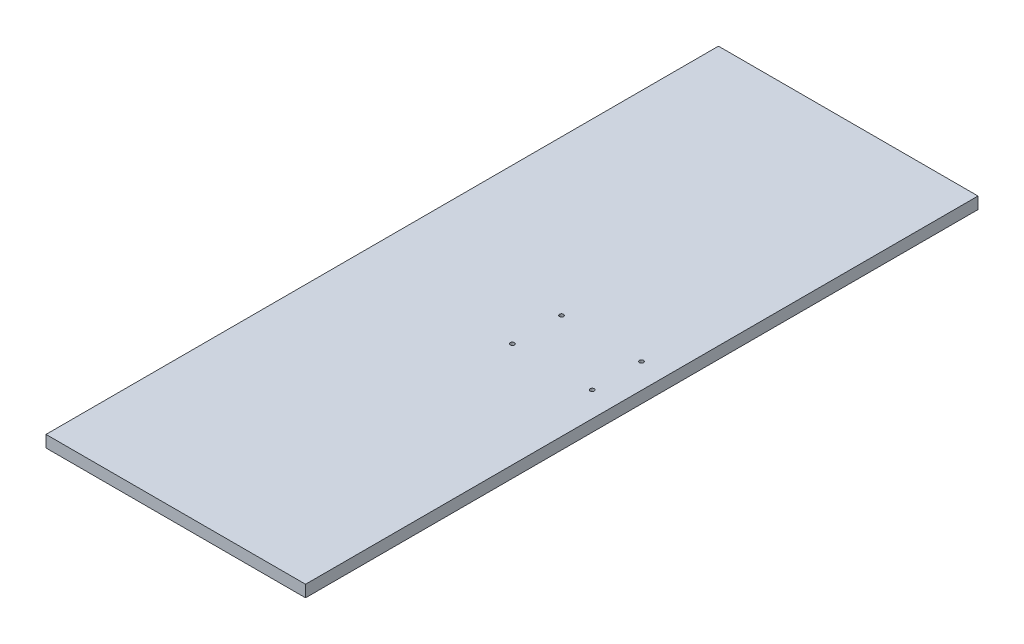
ISO-10303-21;
HEADER;
FILE_DESCRIPTION(('STEP AP214'),'2;1');
FILE_NAME('part.step','',(''),(''),'','','');
FILE_SCHEMA(('AUTOMOTIVE_DESIGN { 1 0 10303 214 1 1 1 1 }'));
ENDSEC;
DATA;
#1=APPLICATION_CONTEXT('core data for automotive mechanical design processes');
#2=APPLICATION_PROTOCOL_DEFINITION('international standard','automotive_design',2000,#1);
#3=PRODUCT_CONTEXT('',#1,'mechanical');
#4=PRODUCT('Part','Part','',(#3));
#5=PRODUCT_RELATED_PRODUCT_CATEGORY('part','',(#4));
#6=PRODUCT_DEFINITION_FORMATION('','',#4);
#7=PRODUCT_DEFINITION_CONTEXT('part definition',#1,'design');
#8=PRODUCT_DEFINITION('design','',#6,#7);
#9=PRODUCT_DEFINITION_SHAPE('','',#8);
#10=(LENGTH_UNIT() NAMED_UNIT(*) SI_UNIT(.MILLI.,.METRE.));
#11=(NAMED_UNIT(*) PLANE_ANGLE_UNIT() SI_UNIT($,.RADIAN.));
#12=(NAMED_UNIT(*) SI_UNIT($,.STERADIAN.) SOLID_ANGLE_UNIT());
#13=UNCERTAINTY_MEASURE_WITH_UNIT(LENGTH_MEASURE(1.E-05),#10,'distance_accuracy_value','');
#14=(GEOMETRIC_REPRESENTATION_CONTEXT(3) GLOBAL_UNCERTAINTY_ASSIGNED_CONTEXT((#13)) GLOBAL_UNIT_ASSIGNED_CONTEXT((#10,
#11,#12)) REPRESENTATION_CONTEXT('',''));
#15=CARTESIAN_POINT('',(0.,0.,0.));
#16=DIRECTION('',(0.,0.,1.));
#17=DIRECTION('',(1.,0.,0.));
#18=AXIS2_PLACEMENT_3D('',#15,#16,#17);
#19=CARTESIAN_POINT('',(-110.,10.,285.));
#20=DIRECTION('',(1.,0.,0.));
#21=DIRECTION('',(0.,0.,-1.));
#22=AXIS2_PLACEMENT_3D('',#19,#20,#21);
#23=PLANE('',#22);
#24=DIRECTION('',(0.,0.,1.));
#25=VECTOR('',#24,1.);
#26=CARTESIAN_POINT('',(-110.,0.,285.));
#27=LINE('',#26,#25);
#28=CARTESIAN_POINT('',(-110.,0.,-285.));
#29=VERTEX_POINT('',#28);
#30=CARTESIAN_POINT('',(-110.,0.,285.));
#31=VERTEX_POINT('',#30);
#32=EDGE_CURVE('E95',#29,#31,#27,.T.);
#33=ORIENTED_EDGE('',*,*,#32,.T.);
#34=DIRECTION('',(0.,-1.,0.));
#35=VECTOR('',#34,1.);
#36=CARTESIAN_POINT('',(-110.,10.,285.));
#37=LINE('',#36,#35);
#38=CARTESIAN_POINT('',(-110.,10.,285.));
#39=VERTEX_POINT('',#38);
#40=EDGE_CURVE('E11',#39,#31,#37,.T.);
#41=ORIENTED_EDGE('',*,*,#40,.F.);
#42=DIRECTION('',(0.,0.,1.));
#43=VECTOR('',#42,1.);
#44=CARTESIAN_POINT('',(-110.,10.,285.));
#45=LINE('',#44,#43);
#46=CARTESIAN_POINT('',(-110.,10.,-285.));
#47=VERTEX_POINT('',#46);
#48=EDGE_CURVE('E83',#47,#39,#45,.T.);
#49=ORIENTED_EDGE('',*,*,#48,.F.);
#50=DIRECTION('',(0.,-1.,0.));
#51=VECTOR('',#50,1.);
#52=CARTESIAN_POINT('',(-110.,10.,-285.));
#53=LINE('',#52,#51);
#54=EDGE_CURVE('E91',#47,#29,#53,.T.);
#55=ORIENTED_EDGE('',*,*,#54,.T.);
#56=EDGE_LOOP('',(#33,#41,#49,#55));
#57=FACE_BOUND('',#56,.T.);
#58=ADVANCED_FACE('F32',(#57),#23,.F.);
#59=CARTESIAN_POINT('',(110.,10.,285.));
#60=DIRECTION('',(0.,0.,-1.));
#61=DIRECTION('',(-1.,0.,0.));
#62=AXIS2_PLACEMENT_3D('',#59,#60,#61);
#63=PLANE('',#62);
#64=DIRECTION('',(1.,0.,0.));
#65=VECTOR('',#64,1.);
#66=CARTESIAN_POINT('',(110.,0.,285.));
#67=LINE('',#66,#65);
#68=CARTESIAN_POINT('',(110.,0.,285.));
#69=VERTEX_POINT('',#68);
#70=EDGE_CURVE('E87',#31,#69,#67,.T.);
#71=ORIENTED_EDGE('',*,*,#70,.T.);
#72=DIRECTION('',(0.,-1.,0.));
#73=VECTOR('',#72,1.);
#74=CARTESIAN_POINT('',(110.,10.,285.));
#75=LINE('',#74,#73);
#76=CARTESIAN_POINT('',(110.,10.,285.));
#77=VERTEX_POINT('',#76);
#78=EDGE_CURVE('E40',#77,#69,#75,.T.);
#79=ORIENTED_EDGE('',*,*,#78,.F.);
#80=DIRECTION('',(1.,0.,0.));
#81=VECTOR('',#80,1.);
#82=CARTESIAN_POINT('',(110.,10.,285.));
#83=LINE('',#82,#81);
#84=EDGE_CURVE('E78',#39,#77,#83,.T.);
#85=ORIENTED_EDGE('',*,*,#84,.F.);
#86=ORIENTED_EDGE('',*,*,#40,.T.);
#87=EDGE_LOOP('',(#71,#79,#85,#86));
#88=FACE_BOUND('',#87,.T.);
#89=ADVANCED_FACE('F86',(#88),#63,.F.);
#90=CARTESIAN_POINT('',(110.,10.,285.));
#91=DIRECTION('',(-1.,0.,0.));
#92=DIRECTION('',(0.,0.,1.));
#93=AXIS2_PLACEMENT_3D('',#90,#91,#92);
#94=PLANE('',#93);
#95=DIRECTION('',(0.,0.,-1.));
#96=VECTOR('',#95,1.);
#97=CARTESIAN_POINT('',(110.,0.,285.));
#98=LINE('',#97,#96);
#99=CARTESIAN_POINT('',(110.,0.,-285.));
#100=VERTEX_POINT('',#99);
#101=EDGE_CURVE('E65',#69,#100,#98,.T.);
#102=ORIENTED_EDGE('',*,*,#101,.T.);
#103=DIRECTION('',(0.,-1.,0.));
#104=VECTOR('',#103,1.);
#105=CARTESIAN_POINT('',(110.,10.,-285.));
#106=LINE('',#105,#104);
#107=CARTESIAN_POINT('',(110.,10.,-285.));
#108=VERTEX_POINT('',#107);
#109=EDGE_CURVE('E88',#108,#100,#106,.T.);
#110=ORIENTED_EDGE('',*,*,#109,.F.);
#111=DIRECTION('',(0.,0.,-1.));
#112=VECTOR('',#111,1.);
#113=CARTESIAN_POINT('',(110.,10.,285.));
#114=LINE('',#113,#112);
#115=EDGE_CURVE('E81',#77,#108,#114,.T.);
#116=ORIENTED_EDGE('',*,*,#115,.F.);
#117=ORIENTED_EDGE('',*,*,#78,.T.);
#118=EDGE_LOOP('',(#102,#110,#116,#117));
#119=FACE_BOUND('',#118,.T.);
#120=ADVANCED_FACE('F89',(#119),#94,.F.);
#121=CARTESIAN_POINT('',(110.,10.,-285.));
#122=DIRECTION('',(0.,0.,1.));
#123=DIRECTION('',(1.,0.,0.));
#124=AXIS2_PLACEMENT_3D('',#121,#122,#123);
#125=PLANE('',#124);
#126=DIRECTION('',(-1.,0.,0.));
#127=VECTOR('',#126,1.);
#128=CARTESIAN_POINT('',(110.,0.,-285.));
#129=LINE('',#128,#127);
#130=EDGE_CURVE('E71',#100,#29,#129,.T.);
#131=ORIENTED_EDGE('',*,*,#130,.T.);
#132=ORIENTED_EDGE('',*,*,#54,.F.);
#133=DIRECTION('',(-1.,0.,0.));
#134=VECTOR('',#133,1.);
#135=CARTESIAN_POINT('',(110.,10.,-285.));
#136=LINE('',#135,#134);
#137=EDGE_CURVE('E48',#108,#47,#136,.T.);
#138=ORIENTED_EDGE('',*,*,#137,.F.);
#139=ORIENTED_EDGE('',*,*,#109,.T.);
#140=EDGE_LOOP('',(#131,#132,#138,#139));
#141=FACE_BOUND('',#140,.T.);
#142=ADVANCED_FACE('F103',(#141),#125,.F.);
#143=CARTESIAN_POINT('',(0.,10.,0.));
#144=DIRECTION('',(0.,1.,0.));
#145=DIRECTION('',(0.,0.,1.));
#146=AXIS2_PLACEMENT_3D('',#143,#144,#145);
#147=PLANE('',#146);
#148=CARTESIAN_POINT('',(88.84,10.,-20.84));
#149=DIRECTION('',(0.,1.,0.));
#150=DIRECTION('',(0.,0.,1.));
#151=AXIS2_PLACEMENT_3D('',#148,#149,#150);
#152=CIRCLE('',#151,1.75);
#153=CARTESIAN_POINT('',(88.84,10.,-19.09));
#154=VERTEX_POINT('',#153);
#155=EDGE_CURVE('E122',#154,#154,#152,.T.);
#156=ORIENTED_EDGE('',*,*,#155,.F.);
#157=EDGE_LOOP('',(#156));
#158=FACE_BOUND('',#157,.T.);
#159=CARTESIAN_POINT('',(21.16,10.,20.84));
#160=DIRECTION('',(0.,1.,0.));
#161=DIRECTION('',(0.,0.,1.));
#162=AXIS2_PLACEMENT_3D('',#159,#160,#161);
#163=CIRCLE('',#162,1.75);
#164=CARTESIAN_POINT('',(21.16,10.,22.59));
#165=VERTEX_POINT('',#164);
#166=EDGE_CURVE('E115',#165,#165,#163,.T.);
#167=ORIENTED_EDGE('',*,*,#166,.F.);
#168=EDGE_LOOP('',(#167));
#169=FACE_BOUND('',#168,.T.);
#170=CARTESIAN_POINT('',(88.84,10.,20.84));
#171=DIRECTION('',(0.,1.,0.));
#172=DIRECTION('',(0.,0.,1.));
#173=AXIS2_PLACEMENT_3D('',#170,#171,#172);
#174=CIRCLE('',#173,1.75);
#175=CARTESIAN_POINT('',(88.84,10.,22.59));
#176=VERTEX_POINT('',#175);
#177=EDGE_CURVE('E127',#176,#176,#174,.T.);
#178=ORIENTED_EDGE('',*,*,#177,.F.);
#179=EDGE_LOOP('',(#178));
#180=FACE_BOUND('',#179,.T.);
#181=CARTESIAN_POINT('',(21.16,10.,-20.84));
#182=DIRECTION('',(0.,1.,0.));
#183=DIRECTION('',(0.,0.,1.));
#184=AXIS2_PLACEMENT_3D('',#181,#182,#183);
#185=CIRCLE('',#184,1.75);
#186=CARTESIAN_POINT('',(21.16,10.,-19.09));
#187=VERTEX_POINT('',#186);
#188=EDGE_CURVE('E109',#187,#187,#185,.T.);
#189=ORIENTED_EDGE('',*,*,#188,.F.);
#190=EDGE_LOOP('',(#189));
#191=FACE_BOUND('',#190,.T.);
#192=ORIENTED_EDGE('',*,*,#48,.T.);
#193=ORIENTED_EDGE('',*,*,#84,.T.);
#194=ORIENTED_EDGE('',*,*,#115,.T.);
#195=ORIENTED_EDGE('',*,*,#137,.T.);
#196=EDGE_LOOP('',(#192,#193,#194,#195));
#197=FACE_BOUND('',#196,.T.);
#198=ADVANCED_FACE('F79',(#158,#169,#180,#191,#197),#147,.T.);
#199=CARTESIAN_POINT('',(0.,0.,0.));
#200=DIRECTION('',(0.,1.,0.));
#201=DIRECTION('',(0.,0.,1.));
#202=AXIS2_PLACEMENT_3D('',#199,#200,#201);
#203=PLANE('',#202);
#204=CARTESIAN_POINT('',(88.84,0.,-20.84));
#205=DIRECTION('',(0.,1.,0.));
#206=DIRECTION('',(0.,0.,1.));
#207=AXIS2_PLACEMENT_3D('',#204,#205,#206);
#208=CIRCLE('',#207,1.75);
#209=CARTESIAN_POINT('',(88.84,0.,-19.09));
#210=VERTEX_POINT('',#209);
#211=EDGE_CURVE('E112',#210,#210,#208,.T.);
#212=ORIENTED_EDGE('',*,*,#211,.T.);
#213=EDGE_LOOP('',(#212));
#214=FACE_BOUND('',#213,.T.);
#215=CARTESIAN_POINT('',(21.16,0.,20.84));
#216=DIRECTION('',(0.,1.,0.));
#217=DIRECTION('',(0.,0.,1.));
#218=AXIS2_PLACEMENT_3D('',#215,#216,#217);
#219=CIRCLE('',#218,1.75);
#220=CARTESIAN_POINT('',(21.16,0.,22.59));
#221=VERTEX_POINT('',#220);
#222=EDGE_CURVE('E118',#221,#221,#219,.T.);
#223=ORIENTED_EDGE('',*,*,#222,.T.);
#224=EDGE_LOOP('',(#223));
#225=FACE_BOUND('',#224,.T.);
#226=CARTESIAN_POINT('',(88.84,0.,20.84));
#227=DIRECTION('',(0.,1.,0.));
#228=DIRECTION('',(0.,0.,1.));
#229=AXIS2_PLACEMENT_3D('',#226,#227,#228);
#230=CIRCLE('',#229,1.75);
#231=CARTESIAN_POINT('',(88.84,0.,22.59));
#232=VERTEX_POINT('',#231);
#233=EDGE_CURVE('E119',#232,#232,#230,.T.);
#234=ORIENTED_EDGE('',*,*,#233,.T.);
#235=EDGE_LOOP('',(#234));
#236=FACE_BOUND('',#235,.T.);
#237=CARTESIAN_POINT('',(21.16,0.,-20.84));
#238=DIRECTION('',(0.,1.,0.));
#239=DIRECTION('',(0.,0.,1.));
#240=AXIS2_PLACEMENT_3D('',#237,#238,#239);
#241=CIRCLE('',#240,1.75);
#242=CARTESIAN_POINT('',(21.16,0.,-19.09));
#243=VERTEX_POINT('',#242);
#244=EDGE_CURVE('E98',#243,#243,#241,.T.);
#245=ORIENTED_EDGE('',*,*,#244,.T.);
#246=EDGE_LOOP('',(#245));
#247=FACE_BOUND('',#246,.T.);
#248=ORIENTED_EDGE('',*,*,#32,.F.);
#249=ORIENTED_EDGE('',*,*,#130,.F.);
#250=ORIENTED_EDGE('',*,*,#101,.F.);
#251=ORIENTED_EDGE('',*,*,#70,.F.);
#252=EDGE_LOOP('',(#248,#249,#250,#251));
#253=FACE_BOUND('',#252,.T.);
#254=ADVANCED_FACE('F106',(#214,#225,#236,#247,#253),#203,.F.);
#255=CARTESIAN_POINT('',(21.16,0.,-20.84));
#256=DIRECTION('',(0.,1.,0.));
#257=DIRECTION('',(0.,0.,1.));
#258=AXIS2_PLACEMENT_3D('',#255,#256,#257);
#259=CYLINDRICAL_SURFACE('',#258,1.75);
#260=ORIENTED_EDGE('',*,*,#244,.F.);
#261=EDGE_LOOP('',(#260));
#262=FACE_BOUND('',#261,.T.);
#263=ORIENTED_EDGE('',*,*,#188,.T.);
#264=EDGE_LOOP('',(#263));
#265=FACE_BOUND('',#264,.T.);
#266=ADVANCED_FACE('F139',(#262,#265),#259,.F.);
#267=CARTESIAN_POINT('',(88.84,0.,20.84));
#268=DIRECTION('',(0.,1.,0.));
#269=DIRECTION('',(0.,0.,1.));
#270=AXIS2_PLACEMENT_3D('',#267,#268,#269);
#271=CYLINDRICAL_SURFACE('',#270,1.75);
#272=ORIENTED_EDGE('',*,*,#233,.F.);
#273=EDGE_LOOP('',(#272));
#274=FACE_BOUND('',#273,.T.);
#275=ORIENTED_EDGE('',*,*,#177,.T.);
#276=EDGE_LOOP('',(#275));
#277=FACE_BOUND('',#276,.T.);
#278=ADVANCED_FACE('F135',(#274,#277),#271,.F.);
#279=CARTESIAN_POINT('',(21.16,0.,20.84));
#280=DIRECTION('',(0.,1.,0.));
#281=DIRECTION('',(0.,0.,1.));
#282=AXIS2_PLACEMENT_3D('',#279,#280,#281);
#283=CYLINDRICAL_SURFACE('',#282,1.75);
#284=ORIENTED_EDGE('',*,*,#222,.F.);
#285=EDGE_LOOP('',(#284));
#286=FACE_BOUND('',#285,.T.);
#287=ORIENTED_EDGE('',*,*,#166,.T.);
#288=EDGE_LOOP('',(#287));
#289=FACE_BOUND('',#288,.T.);
#290=ADVANCED_FACE('F138',(#286,#289),#283,.F.);
#291=CARTESIAN_POINT('',(88.84,0.,-20.84));
#292=DIRECTION('',(0.,1.,0.));
#293=DIRECTION('',(0.,0.,1.));
#294=AXIS2_PLACEMENT_3D('',#291,#292,#293);
#295=CYLINDRICAL_SURFACE('',#294,1.75);
#296=ORIENTED_EDGE('',*,*,#211,.F.);
#297=EDGE_LOOP('',(#296));
#298=FACE_BOUND('',#297,.T.);
#299=ORIENTED_EDGE('',*,*,#155,.T.);
#300=EDGE_LOOP('',(#299));
#301=FACE_BOUND('',#300,.T.);
#302=ADVANCED_FACE('F200',(#298,#301),#295,.F.);
#303=CLOSED_SHELL('',(#58,#89,#120,#142,#198,#254,#266,#278,#290,#302));
#304=MANIFOLD_SOLID_BREP('B2',#303);
#305=ADVANCED_BREP_SHAPE_REPRESENTATION('',(#18,#304),#14);
#306=SHAPE_DEFINITION_REPRESENTATION(#9,#305);
ENDSEC;
END-ISO-10303-21;
